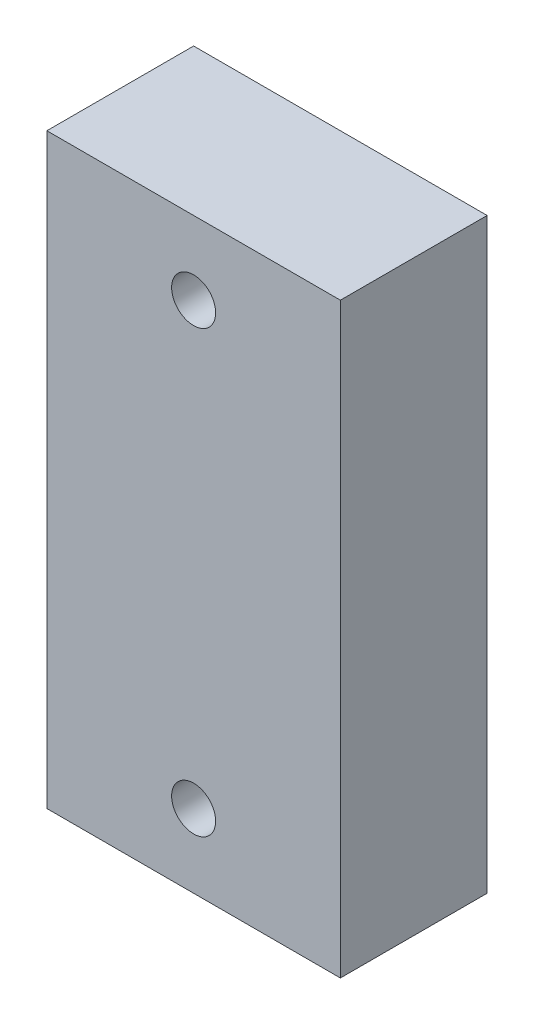
ISO-10303-21;
HEADER;
FILE_DESCRIPTION(('STEP AP214'),'2;1');
FILE_NAME('part.step','',(''),(''),'','','');
FILE_SCHEMA(('AUTOMOTIVE_DESIGN { 1 0 10303 214 1 1 1 1 }'));
ENDSEC;
DATA;
#1=APPLICATION_CONTEXT('core data for automotive mechanical design processes');
#2=APPLICATION_PROTOCOL_DEFINITION('international standard','automotive_design',2000,#1);
#3=PRODUCT_CONTEXT('',#1,'mechanical');
#4=PRODUCT('Part','Part','',(#3));
#5=PRODUCT_RELATED_PRODUCT_CATEGORY('part','',(#4));
#6=PRODUCT_DEFINITION_FORMATION('','',#4);
#7=PRODUCT_DEFINITION_CONTEXT('part definition',#1,'design');
#8=PRODUCT_DEFINITION('design','',#6,#7);
#9=PRODUCT_DEFINITION_SHAPE('','',#8);
#10=(LENGTH_UNIT() NAMED_UNIT(*) SI_UNIT(.MILLI.,.METRE.));
#11=(NAMED_UNIT(*) PLANE_ANGLE_UNIT() SI_UNIT($,.RADIAN.));
#12=(NAMED_UNIT(*) SI_UNIT($,.STERADIAN.) SOLID_ANGLE_UNIT());
#13=UNCERTAINTY_MEASURE_WITH_UNIT(LENGTH_MEASURE(1.E-05),#10,'distance_accuracy_value','');
#14=(GEOMETRIC_REPRESENTATION_CONTEXT(3) GLOBAL_UNCERTAINTY_ASSIGNED_CONTEXT((#13)) GLOBAL_UNIT_ASSIGNED_CONTEXT((#10,
#11,#12)) REPRESENTATION_CONTEXT('',''));
#15=CARTESIAN_POINT('',(0.,0.,0.));
#16=DIRECTION('',(0.,0.,1.));
#17=DIRECTION('',(1.,0.,0.));
#18=AXIS2_PLACEMENT_3D('',#15,#16,#17);
#19=CARTESIAN_POINT('',(0.,40.,10.));
#20=DIRECTION('',(0.,0.,1.));
#21=DIRECTION('',(1.,0.,0.));
#22=AXIS2_PLACEMENT_3D('',#19,#20,#21);
#23=PLANE('',#22);
#24=CARTESIAN_POINT('',(-10.,35.,10.));
#25=DIRECTION('',(0.,0.,1.));
#26=DIRECTION('',(1.,0.,0.));
#27=AXIS2_PLACEMENT_3D('',#24,#25,#26);
#28=CIRCLE('',#27,1.5);
#29=CARTESIAN_POINT('',(-8.5,35.,10.));
#30=VERTEX_POINT('',#29);
#31=EDGE_CURVE('E100',#30,#30,#28,.T.);
#32=ORIENTED_EDGE('',*,*,#31,.F.);
#33=EDGE_LOOP('',(#32));
#34=FACE_BOUND('',#33,.T.);
#35=DIRECTION('',(0.,1.,0.));
#36=VECTOR('',#35,1.);
#37=CARTESIAN_POINT('',(0.,0.,10.));
#38=LINE('',#37,#36);
#39=CARTESIAN_POINT('',(0.,0.,10.));
#40=VERTEX_POINT('',#39);
#41=CARTESIAN_POINT('',(0.,40.,10.));
#42=VERTEX_POINT('',#41);
#43=EDGE_CURVE('E85',#40,#42,#38,.T.);
#44=ORIENTED_EDGE('',*,*,#43,.T.);
#45=DIRECTION('',(-1.,0.,0.));
#46=VECTOR('',#45,1.);
#47=CARTESIAN_POINT('',(0.,40.,10.));
#48=LINE('',#47,#46);
#49=CARTESIAN_POINT('',(-20.,40.,10.));
#50=VERTEX_POINT('',#49);
#51=EDGE_CURVE('E80',#42,#50,#48,.T.);
#52=ORIENTED_EDGE('',*,*,#51,.T.);
#53=DIRECTION('',(0.,-1.,0.));
#54=VECTOR('',#53,1.);
#55=CARTESIAN_POINT('',(-20.,0.,10.));
#56=LINE('',#55,#54);
#57=CARTESIAN_POINT('',(-20.,0.,10.));
#58=VERTEX_POINT('',#57);
#59=EDGE_CURVE('E83',#50,#58,#56,.T.);
#60=ORIENTED_EDGE('',*,*,#59,.T.);
#61=DIRECTION('',(1.,0.,0.));
#62=VECTOR('',#61,1.);
#63=CARTESIAN_POINT('',(0.,0.,10.));
#64=LINE('',#63,#62);
#65=EDGE_CURVE('E50',#58,#40,#64,.T.);
#66=ORIENTED_EDGE('',*,*,#65,.T.);
#67=EDGE_LOOP('',(#44,#52,#60,#66));
#68=FACE_BOUND('',#67,.T.);
#69=CARTESIAN_POINT('',(-10.,5.,10.));
#70=DIRECTION('',(0.,0.,1.));
#71=DIRECTION('',(1.,0.,0.));
#72=AXIS2_PLACEMENT_3D('',#69,#70,#71);
#73=CIRCLE('',#72,1.5);
#74=CARTESIAN_POINT('',(-8.5,5.,10.));
#75=VERTEX_POINT('',#74);
#76=EDGE_CURVE('E115',#75,#75,#73,.T.);
#77=ORIENTED_EDGE('',*,*,#76,.F.);
#78=EDGE_LOOP('',(#77));
#79=FACE_BOUND('',#78,.T.);
#80=ADVANCED_FACE('F33',(#34,#68,#79),#23,.T.);
#81=CARTESIAN_POINT('',(0.,40.,0.));
#82=DIRECTION('',(0.,0.,1.));
#83=DIRECTION('',(1.,0.,0.));
#84=AXIS2_PLACEMENT_3D('',#81,#82,#83);
#85=PLANE('',#84);
#86=CARTESIAN_POINT('',(-10.,35.,0.));
#87=DIRECTION('',(0.,0.,1.));
#88=DIRECTION('',(1.,0.,0.));
#89=AXIS2_PLACEMENT_3D('',#86,#87,#88);
#90=CIRCLE('',#89,1.5);
#91=CARTESIAN_POINT('',(-8.5,35.,0.));
#92=VERTEX_POINT('',#91);
#93=EDGE_CURVE('E112',#92,#92,#90,.T.);
#94=ORIENTED_EDGE('',*,*,#93,.T.);
#95=EDGE_LOOP('',(#94));
#96=FACE_BOUND('',#95,.T.);
#97=DIRECTION('',(0.,1.,0.));
#98=VECTOR('',#97,1.);
#99=CARTESIAN_POINT('',(0.,0.,0.));
#100=LINE('',#99,#98);
#101=CARTESIAN_POINT('',(0.,0.,0.));
#102=VERTEX_POINT('',#101);
#103=CARTESIAN_POINT('',(0.,40.,0.));
#104=VERTEX_POINT('',#103);
#105=EDGE_CURVE('E97',#102,#104,#100,.T.);
#106=ORIENTED_EDGE('',*,*,#105,.F.);
#107=DIRECTION('',(1.,0.,0.));
#108=VECTOR('',#107,1.);
#109=CARTESIAN_POINT('',(0.,0.,0.));
#110=LINE('',#109,#108);
#111=CARTESIAN_POINT('',(-20.,0.,0.));
#112=VERTEX_POINT('',#111);
#113=EDGE_CURVE('E73',#112,#102,#110,.T.);
#114=ORIENTED_EDGE('',*,*,#113,.F.);
#115=DIRECTION('',(0.,-1.,0.));
#116=VECTOR('',#115,1.);
#117=CARTESIAN_POINT('',(-20.,0.,0.));
#118=LINE('',#117,#116);
#119=CARTESIAN_POINT('',(-20.,40.,0.));
#120=VERTEX_POINT('',#119);
#121=EDGE_CURVE('E67',#120,#112,#118,.T.);
#122=ORIENTED_EDGE('',*,*,#121,.F.);
#123=DIRECTION('',(-1.,0.,0.));
#124=VECTOR('',#123,1.);
#125=CARTESIAN_POINT('',(0.,40.,0.));
#126=LINE('',#125,#124);
#127=EDGE_CURVE('E89',#104,#120,#126,.T.);
#128=ORIENTED_EDGE('',*,*,#127,.F.);
#129=EDGE_LOOP('',(#106,#114,#122,#128));
#130=FACE_BOUND('',#129,.T.);
#131=CARTESIAN_POINT('',(-10.,5.,0.));
#132=DIRECTION('',(0.,0.,1.));
#133=DIRECTION('',(1.,0.,0.));
#134=AXIS2_PLACEMENT_3D('',#131,#132,#133);
#135=CIRCLE('',#134,1.5);
#136=CARTESIAN_POINT('',(-8.5,5.,0.));
#137=VERTEX_POINT('',#136);
#138=EDGE_CURVE('E118',#137,#137,#135,.T.);
#139=ORIENTED_EDGE('',*,*,#138,.T.);
#140=EDGE_LOOP('',(#139));
#141=FACE_BOUND('',#140,.T.);
#142=ADVANCED_FACE('F108',(#96,#130,#141),#85,.F.);
#143=CARTESIAN_POINT('',(0.,0.,10.));
#144=DIRECTION('',(-1.,0.,0.));
#145=DIRECTION('',(0.,0.,1.));
#146=AXIS2_PLACEMENT_3D('',#143,#144,#145);
#147=PLANE('',#146);
#148=ORIENTED_EDGE('',*,*,#105,.T.);
#149=DIRECTION('',(0.,0.,-1.));
#150=VECTOR('',#149,1.);
#151=CARTESIAN_POINT('',(0.,40.,10.));
#152=LINE('',#151,#150);
#153=EDGE_CURVE('E11',#42,#104,#152,.T.);
#154=ORIENTED_EDGE('',*,*,#153,.F.);
#155=ORIENTED_EDGE('',*,*,#43,.F.);
#156=DIRECTION('',(0.,0.,-1.));
#157=VECTOR('',#156,1.);
#158=CARTESIAN_POINT('',(0.,0.,10.));
#159=LINE('',#158,#157);
#160=EDGE_CURVE('E93',#40,#102,#159,.T.);
#161=ORIENTED_EDGE('',*,*,#160,.T.);
#162=EDGE_LOOP('',(#148,#154,#155,#161));
#163=FACE_BOUND('',#162,.T.);
#164=ADVANCED_FACE('F35',(#163),#147,.F.);
#165=CARTESIAN_POINT('',(0.,40.,10.));
#166=DIRECTION('',(0.,-1.,0.));
#167=DIRECTION('',(1.,0.,0.));
#168=AXIS2_PLACEMENT_3D('',#165,#166,#167);
#169=PLANE('',#168);
#170=ORIENTED_EDGE('',*,*,#127,.T.);
#171=DIRECTION('',(0.,0.,-1.));
#172=VECTOR('',#171,1.);
#173=CARTESIAN_POINT('',(-20.,40.,10.));
#174=LINE('',#173,#172);
#175=EDGE_CURVE('E42',#50,#120,#174,.T.);
#176=ORIENTED_EDGE('',*,*,#175,.F.);
#177=ORIENTED_EDGE('',*,*,#51,.F.);
#178=ORIENTED_EDGE('',*,*,#153,.T.);
#179=EDGE_LOOP('',(#170,#176,#177,#178));
#180=FACE_BOUND('',#179,.T.);
#181=ADVANCED_FACE('F88',(#180),#169,.F.);
#182=CARTESIAN_POINT('',(-20.,0.,10.));
#183=DIRECTION('',(1.,0.,0.));
#184=DIRECTION('',(0.,0.,-1.));
#185=AXIS2_PLACEMENT_3D('',#182,#183,#184);
#186=PLANE('',#185);
#187=ORIENTED_EDGE('',*,*,#121,.T.);
#188=DIRECTION('',(0.,0.,-1.));
#189=VECTOR('',#188,1.);
#190=CARTESIAN_POINT('',(-20.,0.,10.));
#191=LINE('',#190,#189);
#192=EDGE_CURVE('E90',#58,#112,#191,.T.);
#193=ORIENTED_EDGE('',*,*,#192,.F.);
#194=ORIENTED_EDGE('',*,*,#59,.F.);
#195=ORIENTED_EDGE('',*,*,#175,.T.);
#196=EDGE_LOOP('',(#187,#193,#194,#195));
#197=FACE_BOUND('',#196,.T.);
#198=ADVANCED_FACE('F91',(#197),#186,.F.);
#199=CARTESIAN_POINT('',(0.,0.,10.));
#200=DIRECTION('',(0.,1.,0.));
#201=DIRECTION('',(-1.,0.,0.));
#202=AXIS2_PLACEMENT_3D('',#199,#200,#201);
#203=PLANE('',#202);
#204=ORIENTED_EDGE('',*,*,#113,.T.);
#205=ORIENTED_EDGE('',*,*,#160,.F.);
#206=ORIENTED_EDGE('',*,*,#65,.F.);
#207=ORIENTED_EDGE('',*,*,#192,.T.);
#208=EDGE_LOOP('',(#204,#205,#206,#207));
#209=FACE_BOUND('',#208,.T.);
#210=ADVANCED_FACE('F105',(#209),#203,.F.);
#211=CARTESIAN_POINT('',(-10.,35.,10.));
#212=DIRECTION('',(0.,0.,-1.));
#213=DIRECTION('',(-1.,0.,0.));
#214=AXIS2_PLACEMENT_3D('',#211,#212,#213);
#215=CYLINDRICAL_SURFACE('',#214,1.5);
#216=ORIENTED_EDGE('',*,*,#31,.T.);
#217=EDGE_LOOP('',(#216));
#218=FACE_BOUND('',#217,.T.);
#219=ORIENTED_EDGE('',*,*,#93,.F.);
#220=EDGE_LOOP('',(#219));
#221=FACE_BOUND('',#220,.T.);
#222=ADVANCED_FACE('F136',(#218,#221),#215,.F.);
#223=CARTESIAN_POINT('',(-10.,5.,10.));
#224=DIRECTION('',(0.,0.,-1.));
#225=DIRECTION('',(-1.,0.,0.));
#226=AXIS2_PLACEMENT_3D('',#223,#224,#225);
#227=CYLINDRICAL_SURFACE('',#226,1.5);
#228=ORIENTED_EDGE('',*,*,#76,.T.);
#229=EDGE_LOOP('',(#228));
#230=FACE_BOUND('',#229,.T.);
#231=ORIENTED_EDGE('',*,*,#138,.F.);
#232=EDGE_LOOP('',(#231));
#233=FACE_BOUND('',#232,.T.);
#234=ADVANCED_FACE('F124',(#230,#233),#227,.F.);
#235=CLOSED_SHELL('',(#80,#142,#164,#181,#198,#210,#222,#234));
#236=MANIFOLD_SOLID_BREP('B2',#235);
#237=ADVANCED_BREP_SHAPE_REPRESENTATION('',(#18,#236),#14);
#238=SHAPE_DEFINITION_REPRESENTATION(#9,#237);
ENDSEC;
END-ISO-10303-21;
